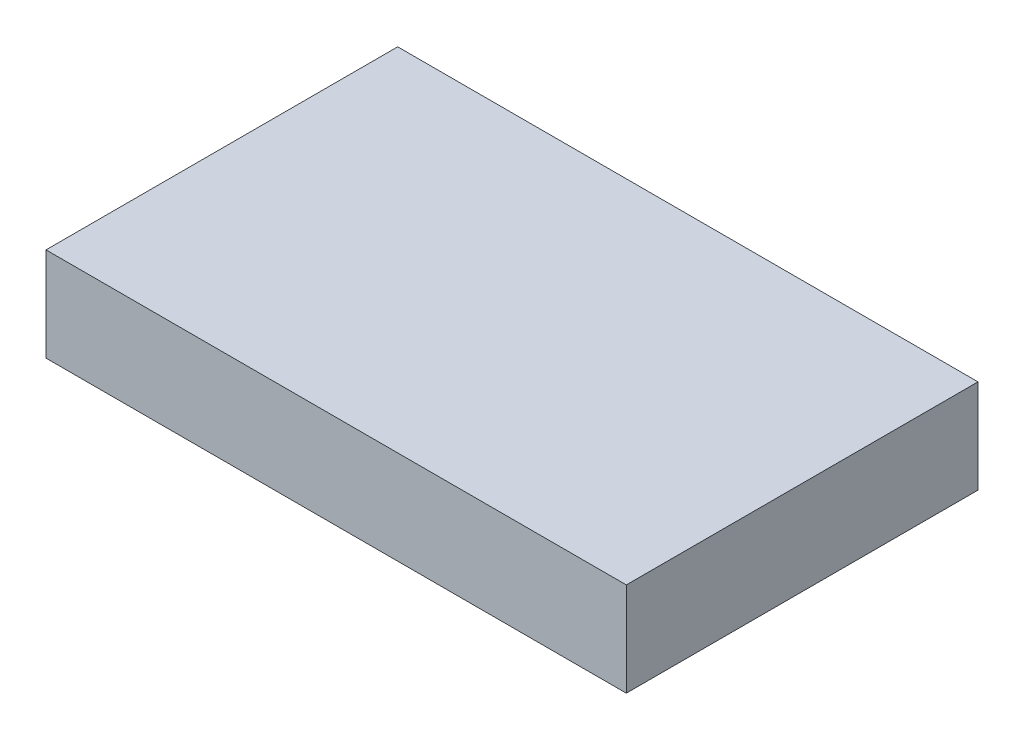
ISO-10303-21;
HEADER;
FILE_DESCRIPTION(('STEP AP214'),'2;1');
FILE_NAME('part.step','',(''),(''),'','','');
FILE_SCHEMA(('AUTOMOTIVE_DESIGN { 1 0 10303 214 1 1 1 1 }'));
ENDSEC;
DATA;
#1=APPLICATION_CONTEXT('core data for automotive mechanical design processes');
#2=APPLICATION_PROTOCOL_DEFINITION('international standard','automotive_design',2000,#1);
#3=PRODUCT_CONTEXT('',#1,'mechanical');
#4=PRODUCT('Part','Part','',(#3));
#5=PRODUCT_RELATED_PRODUCT_CATEGORY('part','',(#4));
#6=PRODUCT_DEFINITION_FORMATION('','',#4);
#7=PRODUCT_DEFINITION_CONTEXT('part definition',#1,'design');
#8=PRODUCT_DEFINITION('design','',#6,#7);
#9=PRODUCT_DEFINITION_SHAPE('','',#8);
#10=(LENGTH_UNIT() NAMED_UNIT(*) SI_UNIT(.MILLI.,.METRE.));
#11=(NAMED_UNIT(*) PLANE_ANGLE_UNIT() SI_UNIT($,.RADIAN.));
#12=(NAMED_UNIT(*) SI_UNIT($,.STERADIAN.) SOLID_ANGLE_UNIT());
#13=UNCERTAINTY_MEASURE_WITH_UNIT(LENGTH_MEASURE(1.E-05),#10,'distance_accuracy_value','');
#14=(GEOMETRIC_REPRESENTATION_CONTEXT(3) GLOBAL_UNCERTAINTY_ASSIGNED_CONTEXT((#13)) GLOBAL_UNIT_ASSIGNED_CONTEXT((#10,
#11,#12)) REPRESENTATION_CONTEXT('',''));
#15=CARTESIAN_POINT('',(0.,0.,0.));
#16=DIRECTION('',(0.,0.,1.));
#17=DIRECTION('',(1.,0.,0.));
#18=AXIS2_PLACEMENT_3D('',#15,#16,#17);
#19=CARTESIAN_POINT('',(0.,1.6,0.));
#20=DIRECTION('',(1.,0.,0.));
#21=DIRECTION('',(0.,0.,-1.));
#22=AXIS2_PLACEMENT_3D('',#19,#20,#21);
#23=PLANE('',#22);
#24=DIRECTION('',(0.,0.,1.));
#25=VECTOR('',#24,1.);
#26=CARTESIAN_POINT('',(0.,0.,0.));
#27=LINE('',#26,#25);
#28=CARTESIAN_POINT('',(0.,0.,-6.));
#29=VERTEX_POINT('',#28);
#30=CARTESIAN_POINT('',(0.,0.,0.));
#31=VERTEX_POINT('',#30);
#32=EDGE_CURVE('E100',#29,#31,#27,.T.);
#33=ORIENTED_EDGE('',*,*,#32,.T.);
#34=DIRECTION('',(0.,-1.,0.));
#35=VECTOR('',#34,1.);
#36=CARTESIAN_POINT('',(0.,1.6,0.));
#37=LINE('',#36,#35);
#38=CARTESIAN_POINT('',(0.,1.6,0.));
#39=VERTEX_POINT('',#38);
#40=EDGE_CURVE('E11',#39,#31,#37,.T.);
#41=ORIENTED_EDGE('',*,*,#40,.F.);
#42=DIRECTION('',(0.,0.,1.));
#43=VECTOR('',#42,1.);
#44=CARTESIAN_POINT('',(0.,1.6,0.));
#45=LINE('',#44,#43);
#46=CARTESIAN_POINT('',(0.,1.6,-6.));
#47=VERTEX_POINT('',#46);
#48=EDGE_CURVE('E88',#47,#39,#45,.T.);
#49=ORIENTED_EDGE('',*,*,#48,.F.);
#50=DIRECTION('',(0.,-1.,0.));
#51=VECTOR('',#50,1.);
#52=CARTESIAN_POINT('',(0.,1.6,-6.));
#53=LINE('',#52,#51);
#54=EDGE_CURVE('E96',#47,#29,#53,.T.);
#55=ORIENTED_EDGE('',*,*,#54,.T.);
#56=EDGE_LOOP('',(#33,#41,#49,#55));
#57=FACE_BOUND('',#56,.T.);
#58=ADVANCED_FACE('F37',(#57),#23,.F.);
#59=CARTESIAN_POINT('',(0.,1.6,0.));
#60=DIRECTION('',(0.,0.,-1.));
#61=DIRECTION('',(-1.,0.,0.));
#62=AXIS2_PLACEMENT_3D('',#59,#60,#61);
#63=PLANE('',#62);
#64=DIRECTION('',(1.,0.,0.));
#65=VECTOR('',#64,1.);
#66=CARTESIAN_POINT('',(0.,0.,0.));
#67=LINE('',#66,#65);
#68=CARTESIAN_POINT('',(9.9,0.,0.));
#69=VERTEX_POINT('',#68);
#70=EDGE_CURVE('E92',#31,#69,#67,.T.);
#71=ORIENTED_EDGE('',*,*,#70,.T.);
#72=DIRECTION('',(0.,-1.,0.));
#73=VECTOR('',#72,1.);
#74=CARTESIAN_POINT('',(9.9,1.6,0.));
#75=LINE('',#74,#73);
#76=CARTESIAN_POINT('',(9.9,1.6,0.));
#77=VERTEX_POINT('',#76);
#78=EDGE_CURVE('E45',#77,#69,#75,.T.);
#79=ORIENTED_EDGE('',*,*,#78,.F.);
#80=DIRECTION('',(1.,0.,0.));
#81=VECTOR('',#80,1.);
#82=CARTESIAN_POINT('',(0.,1.6,0.));
#83=LINE('',#82,#81);
#84=EDGE_CURVE('E83',#39,#77,#83,.T.);
#85=ORIENTED_EDGE('',*,*,#84,.F.);
#86=ORIENTED_EDGE('',*,*,#40,.T.);
#87=EDGE_LOOP('',(#71,#79,#85,#86));
#88=FACE_BOUND('',#87,.T.);
#89=ADVANCED_FACE('F91',(#88),#63,.F.);
#90=CARTESIAN_POINT('',(9.9,1.6,0.));
#91=DIRECTION('',(-1.,0.,0.));
#92=DIRECTION('',(0.,0.,1.));
#93=AXIS2_PLACEMENT_3D('',#90,#91,#92);
#94=PLANE('',#93);
#95=DIRECTION('',(0.,0.,-1.));
#96=VECTOR('',#95,1.);
#97=CARTESIAN_POINT('',(9.9,0.,0.));
#98=LINE('',#97,#96);
#99=CARTESIAN_POINT('',(9.9,0.,-6.));
#100=VERTEX_POINT('',#99);
#101=EDGE_CURVE('E70',#69,#100,#98,.T.);
#102=ORIENTED_EDGE('',*,*,#101,.T.);
#103=DIRECTION('',(0.,-1.,0.));
#104=VECTOR('',#103,1.);
#105=CARTESIAN_POINT('',(9.9,1.6,-6.));
#106=LINE('',#105,#104);
#107=CARTESIAN_POINT('',(9.9,1.6,-6.));
#108=VERTEX_POINT('',#107);
#109=EDGE_CURVE('E93',#108,#100,#106,.T.);
#110=ORIENTED_EDGE('',*,*,#109,.F.);
#111=DIRECTION('',(0.,0.,-1.));
#112=VECTOR('',#111,1.);
#113=CARTESIAN_POINT('',(9.9,1.6,0.));
#114=LINE('',#113,#112);
#115=EDGE_CURVE('E86',#77,#108,#114,.T.);
#116=ORIENTED_EDGE('',*,*,#115,.F.);
#117=ORIENTED_EDGE('',*,*,#78,.T.);
#118=EDGE_LOOP('',(#102,#110,#116,#117));
#119=FACE_BOUND('',#118,.T.);
#120=ADVANCED_FACE('F94',(#119),#94,.F.);
#121=CARTESIAN_POINT('',(0.,1.6,-6.));
#122=DIRECTION('',(0.,0.,1.));
#123=DIRECTION('',(1.,0.,0.));
#124=AXIS2_PLACEMENT_3D('',#121,#122,#123);
#125=PLANE('',#124);
#126=DIRECTION('',(-1.,0.,0.));
#127=VECTOR('',#126,1.);
#128=CARTESIAN_POINT('',(0.,0.,-6.));
#129=LINE('',#128,#127);
#130=EDGE_CURVE('E76',#100,#29,#129,.T.);
#131=ORIENTED_EDGE('',*,*,#130,.T.);
#132=ORIENTED_EDGE('',*,*,#54,.F.);
#133=DIRECTION('',(-1.,0.,0.));
#134=VECTOR('',#133,1.);
#135=CARTESIAN_POINT('',(0.,1.6,-6.));
#136=LINE('',#135,#134);
#137=EDGE_CURVE('E53',#108,#47,#136,.T.);
#138=ORIENTED_EDGE('',*,*,#137,.F.);
#139=ORIENTED_EDGE('',*,*,#109,.T.);
#140=EDGE_LOOP('',(#131,#132,#138,#139));
#141=FACE_BOUND('',#140,.T.);
#142=ADVANCED_FACE('F107',(#141),#125,.F.);
#143=CARTESIAN_POINT('',(0.,1.6,0.));
#144=DIRECTION('',(0.,-1.,0.));
#145=DIRECTION('',(0.,0.,-1.));
#146=AXIS2_PLACEMENT_3D('',#143,#144,#145);
#147=PLANE('',#146);
#148=ORIENTED_EDGE('',*,*,#48,.T.);
#149=ORIENTED_EDGE('',*,*,#84,.T.);
#150=ORIENTED_EDGE('',*,*,#115,.T.);
#151=ORIENTED_EDGE('',*,*,#137,.T.);
#152=EDGE_LOOP('',(#148,#149,#150,#151));
#153=FACE_BOUND('',#152,.T.);
#154=ADVANCED_FACE('F84',(#153),#147,.F.);
#155=CARTESIAN_POINT('',(0.,0.,0.));
#156=DIRECTION('',(0.,-1.,0.));
#157=DIRECTION('',(0.,0.,-1.));
#158=AXIS2_PLACEMENT_3D('',#155,#156,#157);
#159=PLANE('',#158);
#160=ORIENTED_EDGE('',*,*,#32,.F.);
#161=ORIENTED_EDGE('',*,*,#130,.F.);
#162=ORIENTED_EDGE('',*,*,#101,.F.);
#163=ORIENTED_EDGE('',*,*,#70,.F.);
#164=EDGE_LOOP('',(#160,#161,#162,#163));
#165=FACE_BOUND('',#164,.T.);
#166=ADVANCED_FACE('F110',(#165),#159,.T.);
#167=CLOSED_SHELL('',(#58,#89,#120,#142,#154,#166));
#168=MANIFOLD_SOLID_BREP('B2',#167);
#169=ADVANCED_BREP_SHAPE_REPRESENTATION('',(#18,#168),#14);
#170=SHAPE_DEFINITION_REPRESENTATION(#9,#169);
ENDSEC;
END-ISO-10303-21;
